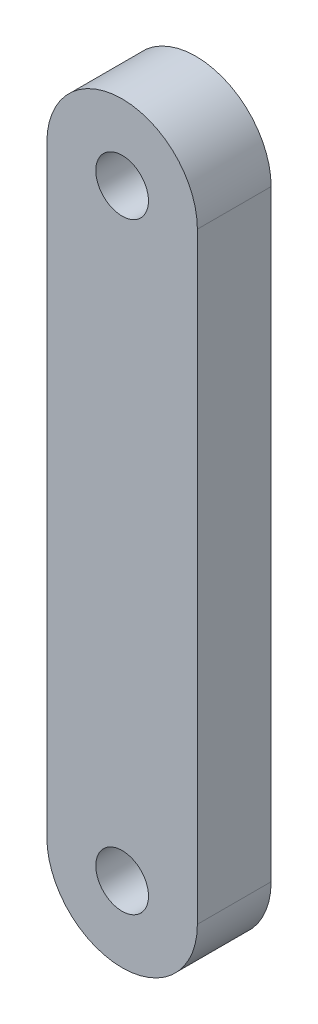
ISO-10303-21;
HEADER;
FILE_DESCRIPTION(('STEP AP214'),'2;1');
FILE_NAME('part.step','',(''),(''),'','','');
FILE_SCHEMA(('AUTOMOTIVE_DESIGN { 1 0 10303 214 1 1 1 1 }'));
ENDSEC;
DATA;
#1=APPLICATION_CONTEXT('core data for automotive mechanical design processes');
#2=APPLICATION_PROTOCOL_DEFINITION('international standard','automotive_design',2000,#1);
#3=PRODUCT_CONTEXT('',#1,'mechanical');
#4=PRODUCT('Part','Part','',(#3));
#5=PRODUCT_RELATED_PRODUCT_CATEGORY('part','',(#4));
#6=PRODUCT_DEFINITION_FORMATION('','',#4);
#7=PRODUCT_DEFINITION_CONTEXT('part definition',#1,'design');
#8=PRODUCT_DEFINITION('design','',#6,#7);
#9=PRODUCT_DEFINITION_SHAPE('','',#8);
#10=(LENGTH_UNIT() NAMED_UNIT(*) SI_UNIT(.MILLI.,.METRE.));
#11=(NAMED_UNIT(*) PLANE_ANGLE_UNIT() SI_UNIT($,.RADIAN.));
#12=(NAMED_UNIT(*) SI_UNIT($,.STERADIAN.) SOLID_ANGLE_UNIT());
#13=UNCERTAINTY_MEASURE_WITH_UNIT(LENGTH_MEASURE(1.E-05),#10,'distance_accuracy_value','');
#14=(GEOMETRIC_REPRESENTATION_CONTEXT(3) GLOBAL_UNCERTAINTY_ASSIGNED_CONTEXT((#13)) GLOBAL_UNIT_ASSIGNED_CONTEXT((#10,
#11,#12)) REPRESENTATION_CONTEXT('',''));
#15=CARTESIAN_POINT('',(0.,0.,0.));
#16=DIRECTION('',(0.,0.,1.));
#17=DIRECTION('',(1.,0.,0.));
#18=AXIS2_PLACEMENT_3D('',#15,#16,#17);
#19=CARTESIAN_POINT('',(0.0214230842861644,17.9209100705597,4.9));
#20=DIRECTION('',(0.,0.,-1.));
#21=DIRECTION('',(-1.,0.,0.));
#22=AXIS2_PLACEMENT_3D('',#19,#20,#21);
#23=PLANE('',#22);
#24=CARTESIAN_POINT('',(0.0214230842861644,17.9209100705597,4.9));
#25=DIRECTION('',(0.,0.,1.));
#26=DIRECTION('',(-1.,0.,0.));
#27=AXIS2_PLACEMENT_3D('',#24,#25,#26);
#28=CIRCLE('',#27,5.);
#29=CARTESIAN_POINT('',(5.02142308428616,17.9209100705597,4.9));
#30=VERTEX_POINT('',#29);
#31=CARTESIAN_POINT('',(-4.97857691571383,17.9209100705597,4.9));
#32=VERTEX_POINT('',#31);
#33=EDGE_CURVE('E85',#30,#32,#28,.T.);
#34=ORIENTED_EDGE('',*,*,#33,.T.);
#35=DIRECTION('',(0.,-1.,0.));
#36=VECTOR('',#35,1.);
#37=CARTESIAN_POINT('',(-4.97857691571383,17.9209100705597,4.9));
#38=LINE('',#37,#36);
#39=CARTESIAN_POINT('',(-4.97857691571383,-22.0790899294403,4.9));
#40=VERTEX_POINT('',#39);
#41=EDGE_CURVE('E80',#32,#40,#38,.T.);
#42=ORIENTED_EDGE('',*,*,#41,.T.);
#43=CARTESIAN_POINT('',(0.0214230842861705,-22.0790899294403,4.9));
#44=DIRECTION('',(0.,0.,1.));
#45=DIRECTION('',(1.,0.,0.));
#46=AXIS2_PLACEMENT_3D('',#43,#44,#45);
#47=CIRCLE('',#46,5.);
#48=CARTESIAN_POINT('',(5.02142308428617,-22.0790899294403,4.9));
#49=VERTEX_POINT('',#48);
#50=EDGE_CURVE('E83',#40,#49,#47,.T.);
#51=ORIENTED_EDGE('',*,*,#50,.T.);
#52=DIRECTION('',(0.,1.,0.));
#53=VECTOR('',#52,1.);
#54=CARTESIAN_POINT('',(5.02142308428616,17.9209100705597,4.9));
#55=LINE('',#54,#53);
#56=EDGE_CURVE('E50',#49,#30,#55,.T.);
#57=ORIENTED_EDGE('',*,*,#56,.T.);
#58=EDGE_LOOP('',(#34,#42,#51,#57));
#59=FACE_BOUND('',#58,.T.);
#60=CARTESIAN_POINT('',(0.0214230842861644,17.9209100705597,4.9));
#61=DIRECTION('',(0.,0.,1.));
#62=DIRECTION('',(1.,0.,0.));
#63=AXIS2_PLACEMENT_3D('',#60,#61,#62);
#64=CIRCLE('',#63,1.75);
#65=CARTESIAN_POINT('',(1.77142308428617,17.9209100705597,4.9));
#66=VERTEX_POINT('',#65);
#67=EDGE_CURVE('E100',#66,#66,#64,.T.);
#68=ORIENTED_EDGE('',*,*,#67,.F.);
#69=EDGE_LOOP('',(#68));
#70=FACE_BOUND('',#69,.T.);
#71=CARTESIAN_POINT('',(0.0214230842861705,-22.0790899294403,4.9));
#72=DIRECTION('',(0.,0.,1.));
#73=DIRECTION('',(1.,0.,0.));
#74=AXIS2_PLACEMENT_3D('',#71,#72,#73);
#75=CIRCLE('',#74,1.75);
#76=CARTESIAN_POINT('',(1.77142308428617,-22.0790899294403,4.9));
#77=VERTEX_POINT('',#76);
#78=EDGE_CURVE('E115',#77,#77,#75,.T.);
#79=ORIENTED_EDGE('',*,*,#78,.F.);
#80=EDGE_LOOP('',(#79));
#81=FACE_BOUND('',#80,.T.);
#82=ADVANCED_FACE('F33',(#59,#70,#81),#23,.F.);
#83=CARTESIAN_POINT('',(0.0214230842861644,17.9209100705597,0.));
#84=DIRECTION('',(0.,0.,-1.));
#85=DIRECTION('',(-1.,0.,0.));
#86=AXIS2_PLACEMENT_3D('',#83,#84,#85);
#87=PLANE('',#86);
#88=CARTESIAN_POINT('',(0.0214230842861644,17.9209100705597,0.));
#89=DIRECTION('',(0.,0.,1.));
#90=DIRECTION('',(1.,0.,0.));
#91=AXIS2_PLACEMENT_3D('',#88,#89,#90);
#92=CIRCLE('',#91,1.75);
#93=CARTESIAN_POINT('',(1.77142308428617,17.9209100705597,0.));
#94=VERTEX_POINT('',#93);
#95=EDGE_CURVE('E112',#94,#94,#92,.T.);
#96=ORIENTED_EDGE('',*,*,#95,.T.);
#97=EDGE_LOOP('',(#96));
#98=FACE_BOUND('',#97,.T.);
#99=CARTESIAN_POINT('',(0.0214230842861644,17.9209100705597,0.));
#100=DIRECTION('',(0.,0.,1.));
#101=DIRECTION('',(-1.,0.,0.));
#102=AXIS2_PLACEMENT_3D('',#99,#100,#101);
#103=CIRCLE('',#102,5.);
#104=CARTESIAN_POINT('',(5.02142308428616,17.9209100705597,0.));
#105=VERTEX_POINT('',#104);
#106=CARTESIAN_POINT('',(-4.97857691571383,17.9209100705597,0.));
#107=VERTEX_POINT('',#106);
#108=EDGE_CURVE('E97',#105,#107,#103,.T.);
#109=ORIENTED_EDGE('',*,*,#108,.F.);
#110=DIRECTION('',(0.,1.,0.));
#111=VECTOR('',#110,1.);
#112=CARTESIAN_POINT('',(5.02142308428616,17.9209100705597,0.));
#113=LINE('',#112,#111);
#114=CARTESIAN_POINT('',(5.02142308428617,-22.0790899294403,0.));
#115=VERTEX_POINT('',#114);
#116=EDGE_CURVE('E73',#115,#105,#113,.T.);
#117=ORIENTED_EDGE('',*,*,#116,.F.);
#118=CARTESIAN_POINT('',(0.0214230842861705,-22.0790899294403,0.));
#119=DIRECTION('',(0.,0.,1.));
#120=DIRECTION('',(1.,0.,0.));
#121=AXIS2_PLACEMENT_3D('',#118,#119,#120);
#122=CIRCLE('',#121,5.);
#123=CARTESIAN_POINT('',(-4.97857691571383,-22.0790899294403,0.));
#124=VERTEX_POINT('',#123);
#125=EDGE_CURVE('E67',#124,#115,#122,.T.);
#126=ORIENTED_EDGE('',*,*,#125,.F.);
#127=DIRECTION('',(0.,-1.,0.));
#128=VECTOR('',#127,1.);
#129=CARTESIAN_POINT('',(-4.97857691571383,17.9209100705597,0.));
#130=LINE('',#129,#128);
#131=EDGE_CURVE('E89',#107,#124,#130,.T.);
#132=ORIENTED_EDGE('',*,*,#131,.F.);
#133=EDGE_LOOP('',(#109,#117,#126,#132));
#134=FACE_BOUND('',#133,.T.);
#135=CARTESIAN_POINT('',(0.0214230842861705,-22.0790899294403,0.));
#136=DIRECTION('',(0.,0.,1.));
#137=DIRECTION('',(1.,0.,0.));
#138=AXIS2_PLACEMENT_3D('',#135,#136,#137);
#139=CIRCLE('',#138,1.75);
#140=CARTESIAN_POINT('',(1.77142308428617,-22.0790899294403,0.));
#141=VERTEX_POINT('',#140);
#142=EDGE_CURVE('E118',#141,#141,#139,.T.);
#143=ORIENTED_EDGE('',*,*,#142,.T.);
#144=EDGE_LOOP('',(#143));
#145=FACE_BOUND('',#144,.T.);
#146=ADVANCED_FACE('F108',(#98,#134,#145),#87,.T.);
#147=CARTESIAN_POINT('',(0.0214230842861644,17.9209100705597,4.9));
#148=DIRECTION('',(0.,0.,-1.));
#149=DIRECTION('',(-1.,0.,0.));
#150=AXIS2_PLACEMENT_3D('',#147,#148,#149);
#151=CYLINDRICAL_SURFACE('',#150,5.);
#152=ORIENTED_EDGE('',*,*,#108,.T.);
#153=DIRECTION('',(0.,0.,-1.));
#154=VECTOR('',#153,1.);
#155=CARTESIAN_POINT('',(-4.97857691571383,17.9209100705597,4.9));
#156=LINE('',#155,#154);
#157=EDGE_CURVE('E11',#32,#107,#156,.T.);
#158=ORIENTED_EDGE('',*,*,#157,.F.);
#159=ORIENTED_EDGE('',*,*,#33,.F.);
#160=DIRECTION('',(0.,0.,-1.));
#161=VECTOR('',#160,1.);
#162=CARTESIAN_POINT('',(5.02142308428616,17.9209100705597,4.9));
#163=LINE('',#162,#161);
#164=EDGE_CURVE('E93',#30,#105,#163,.T.);
#165=ORIENTED_EDGE('',*,*,#164,.T.);
#166=EDGE_LOOP('',(#152,#158,#159,#165));
#167=FACE_BOUND('',#166,.T.);
#168=ADVANCED_FACE('F35',(#167),#151,.T.);
#169=CARTESIAN_POINT('',(-4.97857691571383,17.9209100705597,4.9));
#170=DIRECTION('',(1.,0.,0.));
#171=DIRECTION('',(0.,1.,0.));
#172=AXIS2_PLACEMENT_3D('',#169,#170,#171);
#173=PLANE('',#172);
#174=ORIENTED_EDGE('',*,*,#131,.T.);
#175=DIRECTION('',(0.,0.,-1.));
#176=VECTOR('',#175,1.);
#177=CARTESIAN_POINT('',(-4.97857691571383,-22.0790899294403,4.9));
#178=LINE('',#177,#176);
#179=EDGE_CURVE('E42',#40,#124,#178,.T.);
#180=ORIENTED_EDGE('',*,*,#179,.F.);
#181=ORIENTED_EDGE('',*,*,#41,.F.);
#182=ORIENTED_EDGE('',*,*,#157,.T.);
#183=EDGE_LOOP('',(#174,#180,#181,#182));
#184=FACE_BOUND('',#183,.T.);
#185=ADVANCED_FACE('F88',(#184),#173,.F.);
#186=CARTESIAN_POINT('',(0.0214230842861705,-22.0790899294403,4.9));
#187=DIRECTION('',(0.,0.,-1.));
#188=DIRECTION('',(-1.,0.,0.));
#189=AXIS2_PLACEMENT_3D('',#186,#187,#188);
#190=CYLINDRICAL_SURFACE('',#189,5.);
#191=ORIENTED_EDGE('',*,*,#125,.T.);
#192=DIRECTION('',(0.,0.,-1.));
#193=VECTOR('',#192,1.);
#194=CARTESIAN_POINT('',(5.02142308428617,-22.0790899294403,4.9));
#195=LINE('',#194,#193);
#196=EDGE_CURVE('E90',#49,#115,#195,.T.);
#197=ORIENTED_EDGE('',*,*,#196,.F.);
#198=ORIENTED_EDGE('',*,*,#50,.F.);
#199=ORIENTED_EDGE('',*,*,#179,.T.);
#200=EDGE_LOOP('',(#191,#197,#198,#199));
#201=FACE_BOUND('',#200,.T.);
#202=ADVANCED_FACE('F91',(#201),#190,.T.);
#203=CARTESIAN_POINT('',(5.02142308428616,17.9209100705597,4.9));
#204=DIRECTION('',(-1.,0.,0.));
#205=DIRECTION('',(0.,-1.,0.));
#206=AXIS2_PLACEMENT_3D('',#203,#204,#205);
#207=PLANE('',#206);
#208=ORIENTED_EDGE('',*,*,#116,.T.);
#209=ORIENTED_EDGE('',*,*,#164,.F.);
#210=ORIENTED_EDGE('',*,*,#56,.F.);
#211=ORIENTED_EDGE('',*,*,#196,.T.);
#212=EDGE_LOOP('',(#208,#209,#210,#211));
#213=FACE_BOUND('',#212,.T.);
#214=ADVANCED_FACE('F105',(#213),#207,.F.);
#215=CARTESIAN_POINT('',(0.0214230842861644,17.9209100705597,4.9));
#216=DIRECTION('',(0.,0.,-1.));
#217=DIRECTION('',(-1.,0.,0.));
#218=AXIS2_PLACEMENT_3D('',#215,#216,#217);
#219=CYLINDRICAL_SURFACE('',#218,1.75);
#220=ORIENTED_EDGE('',*,*,#67,.T.);
#221=EDGE_LOOP('',(#220));
#222=FACE_BOUND('',#221,.T.);
#223=ORIENTED_EDGE('',*,*,#95,.F.);
#224=EDGE_LOOP('',(#223));
#225=FACE_BOUND('',#224,.T.);
#226=ADVANCED_FACE('F135',(#222,#225),#219,.F.);
#227=CARTESIAN_POINT('',(0.0214230842861705,-22.0790899294403,4.9));
#228=DIRECTION('',(0.,0.,-1.));
#229=DIRECTION('',(-1.,0.,0.));
#230=AXIS2_PLACEMENT_3D('',#227,#228,#229);
#231=CYLINDRICAL_SURFACE('',#230,1.75);
#232=ORIENTED_EDGE('',*,*,#78,.T.);
#233=EDGE_LOOP('',(#232));
#234=FACE_BOUND('',#233,.T.);
#235=ORIENTED_EDGE('',*,*,#142,.F.);
#236=EDGE_LOOP('',(#235));
#237=FACE_BOUND('',#236,.T.);
#238=ADVANCED_FACE('F124',(#234,#237),#231,.F.);
#239=CLOSED_SHELL('',(#82,#146,#168,#185,#202,#214,#226,#238));
#240=MANIFOLD_SOLID_BREP('B2',#239);
#241=ADVANCED_BREP_SHAPE_REPRESENTATION('',(#18,#240),#14);
#242=SHAPE_DEFINITION_REPRESENTATION(#9,#241);
ENDSEC;
END-ISO-10303-21;
